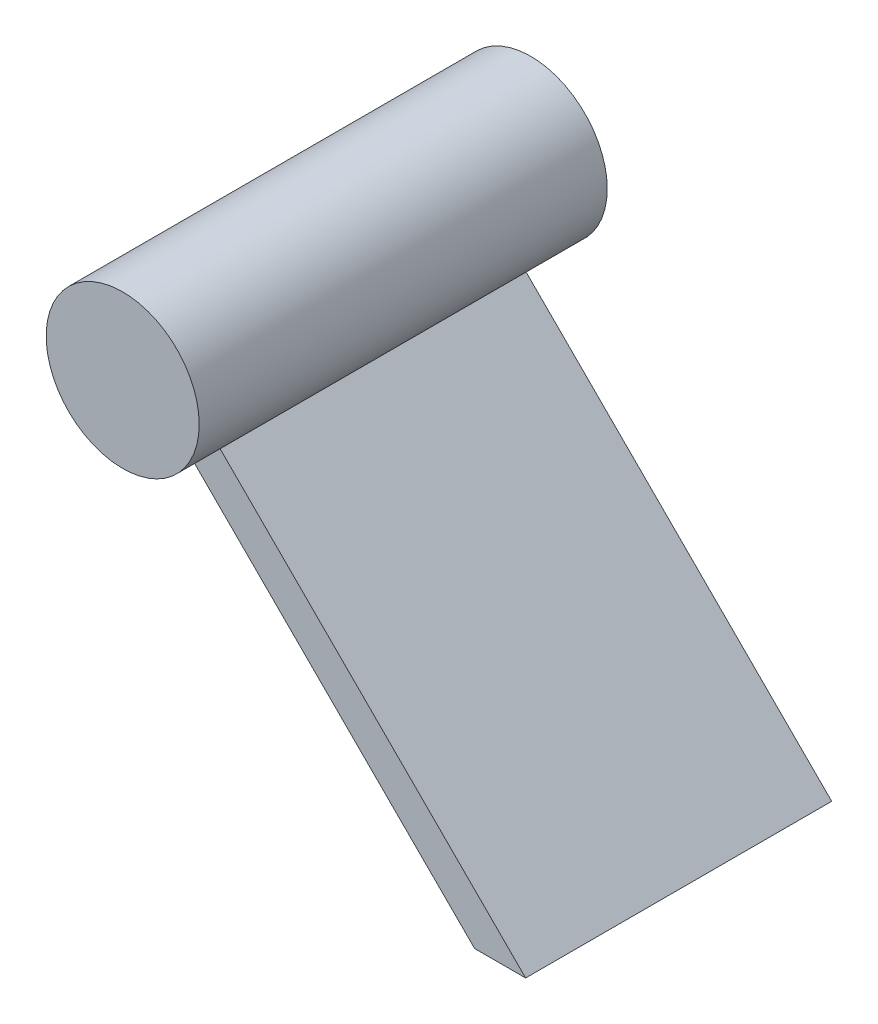
ISO-10303-21;
HEADER;
FILE_DESCRIPTION(('STEP AP214'),'2;1');
FILE_NAME('part.step','',(''),(''),'','','');
FILE_SCHEMA(('AUTOMOTIVE_DESIGN { 1 0 10303 214 1 1 1 1 }'));
ENDSEC;
DATA;
#1=APPLICATION_CONTEXT('core data for automotive mechanical design processes');
#2=APPLICATION_PROTOCOL_DEFINITION('international standard','automotive_design',2000,#1);
#3=PRODUCT_CONTEXT('',#1,'mechanical');
#4=PRODUCT('Part','Part','',(#3));
#5=PRODUCT_RELATED_PRODUCT_CATEGORY('part','',(#4));
#6=PRODUCT_DEFINITION_FORMATION('','',#4);
#7=PRODUCT_DEFINITION_CONTEXT('part definition',#1,'design');
#8=PRODUCT_DEFINITION('design','',#6,#7);
#9=PRODUCT_DEFINITION_SHAPE('','',#8);
#10=(LENGTH_UNIT() NAMED_UNIT(*) SI_UNIT(.MILLI.,.METRE.));
#11=(NAMED_UNIT(*) PLANE_ANGLE_UNIT() SI_UNIT($,.RADIAN.));
#12=(NAMED_UNIT(*) SI_UNIT($,.STERADIAN.) SOLID_ANGLE_UNIT());
#13=UNCERTAINTY_MEASURE_WITH_UNIT(LENGTH_MEASURE(1.E-05),#10,'distance_accuracy_value','');
#14=(GEOMETRIC_REPRESENTATION_CONTEXT(3) GLOBAL_UNCERTAINTY_ASSIGNED_CONTEXT((#13)) GLOBAL_UNIT_ASSIGNED_CONTEXT((#10,
#11,#12)) REPRESENTATION_CONTEXT('',''));
#15=CARTESIAN_POINT('',(0.,0.,0.));
#16=DIRECTION('',(0.,0.,1.));
#17=DIRECTION('',(1.,0.,0.));
#18=AXIS2_PLACEMENT_3D('',#15,#16,#17);
#19=CARTESIAN_POINT('',(0.,0.,15.));
#20=DIRECTION('',(0.707106781186549,0.707106781186546,0.));
#21=DIRECTION('',(-0.707106781186546,0.707106781186549,0.));
#22=AXIS2_PLACEMENT_3D('',#19,#20,#21);
#23=PLANE('',#22);
#24=DIRECTION('',(0.,0.,-1.));
#25=VECTOR('',#24,1.);
#26=CARTESIAN_POINT('',(1.44076365356005,-1.44076365356005,20.));
#27=LINE('',#26,#25);
#28=CARTESIAN_POINT('',(1.44076365356005,-1.44076365356005,-15.));
#29=VERTEX_POINT('',#28);
#30=CARTESIAN_POINT('',(1.44076365356005,-1.44076365356005,15.));
#31=VERTEX_POINT('',#30);
#32=EDGE_CURVE('E160',#29,#31,#27,.F.);
#33=ORIENTED_EDGE('',*,*,#32,.F.);
#34=DIRECTION('',(0.707106781186546,-0.707106781186549,0.));
#35=VECTOR('',#34,1.);
#36=CARTESIAN_POINT('',(0.,0.,-15.));
#37=LINE('',#36,#35);
#38=CARTESIAN_POINT('',(29.9999999999999,-30.,-15.));
#39=VERTEX_POINT('',#38);
#40=EDGE_CURVE('E202',#29,#39,#37,.T.);
#41=ORIENTED_EDGE('',*,*,#40,.T.);
#42=DIRECTION('',(0.,0.,-1.));
#43=VECTOR('',#42,1.);
#44=CARTESIAN_POINT('',(29.9999999999999,-30.,15.));
#45=LINE('',#44,#43);
#46=CARTESIAN_POINT('',(29.9999999999999,-30.,15.));
#47=VERTEX_POINT('',#46);
#48=EDGE_CURVE('E12',#47,#39,#45,.T.);
#49=ORIENTED_EDGE('',*,*,#48,.F.);
#50=DIRECTION('',(0.707106781186546,-0.707106781186549,0.));
#51=VECTOR('',#50,1.);
#52=CARTESIAN_POINT('',(0.,0.,15.));
#53=LINE('',#52,#51);
#54=EDGE_CURVE('E196',#31,#47,#53,.T.);
#55=ORIENTED_EDGE('',*,*,#54,.F.);
#56=EDGE_LOOP('',(#33,#41,#49,#55));
#57=FACE_BOUND('',#56,.T.);
#58=ADVANCED_FACE('F146',(#57),#23,.F.);
#59=CARTESIAN_POINT('',(0.,0.,-15.));
#60=DIRECTION('',(0.,0.,1.));
#61=DIRECTION('',(1.,0.,0.));
#62=AXIS2_PLACEMENT_3D('',#59,#60,#61);
#63=PLANE('',#62);
#64=CARTESIAN_POINT('',(0.5,6.,-15.));
#65=DIRECTION('',(0.,0.,1.));
#66=DIRECTION('',(1.,0.,0.));
#67=AXIS2_PLACEMENT_3D('',#64,#65,#66);
#68=CIRCLE('',#67,7.5);
#69=CARTESIAN_POINT('',(5.,0.,-15.));
#70=VERTEX_POINT('',#69);
#71=EDGE_CURVE('E200',#70,#29,#68,.F.);
#72=ORIENTED_EDGE('',*,*,#71,.F.);
#73=DIRECTION('',(-0.707106781186547,0.707106781186548,0.));
#74=VECTOR('',#73,1.);
#75=CARTESIAN_POINT('',(2.50000000000001,2.5,-15.));
#76=LINE('',#75,#74);
#77=CARTESIAN_POINT('',(34.9999999999999,-30.,-15.));
#78=VERTEX_POINT('',#77);
#79=EDGE_CURVE('E187',#78,#70,#76,.T.);
#80=ORIENTED_EDGE('',*,*,#79,.F.);
#81=DIRECTION('',(1.,0.,0.));
#82=VECTOR('',#81,1.);
#83=CARTESIAN_POINT('',(0.,-30.,-15.));
#84=LINE('',#83,#82);
#85=EDGE_CURVE('E197',#39,#78,#84,.T.);
#86=ORIENTED_EDGE('',*,*,#85,.F.);
#87=ORIENTED_EDGE('',*,*,#40,.F.);
#88=EDGE_LOOP('',(#72,#80,#86,#87));
#89=FACE_BOUND('',#88,.T.);
#90=ADVANCED_FACE('F201',(#89),#63,.F.);
#91=CARTESIAN_POINT('',(0.,-30.,15.));
#92=DIRECTION('',(0.,1.,0.));
#93=DIRECTION('',(-1.,0.,0.));
#94=AXIS2_PLACEMENT_3D('',#91,#92,#93);
#95=PLANE('',#94);
#96=ORIENTED_EDGE('',*,*,#85,.T.);
#97=DIRECTION('',(0.,0.,-1.));
#98=VECTOR('',#97,1.);
#99=CARTESIAN_POINT('',(34.9999999999999,-30.,15.));
#100=LINE('',#99,#98);
#101=CARTESIAN_POINT('',(34.9999999999999,-30.,15.));
#102=VERTEX_POINT('',#101);
#103=EDGE_CURVE('E153',#102,#78,#100,.T.);
#104=ORIENTED_EDGE('',*,*,#103,.F.);
#105=DIRECTION('',(1.,0.,0.));
#106=VECTOR('',#105,1.);
#107=CARTESIAN_POINT('',(0.,-30.,15.));
#108=LINE('',#107,#106);
#109=EDGE_CURVE('E208',#47,#102,#108,.T.);
#110=ORIENTED_EDGE('',*,*,#109,.F.);
#111=ORIENTED_EDGE('',*,*,#48,.T.);
#112=EDGE_LOOP('',(#96,#104,#110,#111));
#113=FACE_BOUND('',#112,.T.);
#114=ADVANCED_FACE('F243',(#113),#95,.F.);
#115=CARTESIAN_POINT('',(2.50000000000001,2.5,15.));
#116=DIRECTION('',(-0.707106781186549,-0.707106781186547,0.));
#117=DIRECTION('',(0.707106781186547,-0.707106781186549,0.));
#118=AXIS2_PLACEMENT_3D('',#115,#116,#117);
#119=PLANE('',#118);
#120=ORIENTED_EDGE('',*,*,#79,.T.);
#121=DIRECTION('',(0.,0.,-1.));
#122=VECTOR('',#121,1.);
#123=CARTESIAN_POINT('',(5.,0.,15.));
#124=LINE('',#123,#122);
#125=CARTESIAN_POINT('',(5.,0.,15.));
#126=VERTEX_POINT('',#125);
#127=EDGE_CURVE('E192',#126,#70,#124,.T.);
#128=ORIENTED_EDGE('',*,*,#127,.F.);
#129=DIRECTION('',(-0.707106781186547,0.707106781186548,0.));
#130=VECTOR('',#129,1.);
#131=CARTESIAN_POINT('',(2.50000000000001,2.5,15.));
#132=LINE('',#131,#130);
#133=EDGE_CURVE('E206',#102,#126,#132,.T.);
#134=ORIENTED_EDGE('',*,*,#133,.F.);
#135=ORIENTED_EDGE('',*,*,#103,.T.);
#136=EDGE_LOOP('',(#120,#128,#134,#135));
#137=FACE_BOUND('',#136,.T.);
#138=ADVANCED_FACE('F189',(#137),#119,.F.);
#139=CARTESIAN_POINT('',(0.,0.,15.));
#140=DIRECTION('',(0.,0.,1.));
#141=DIRECTION('',(1.,0.,0.));
#142=AXIS2_PLACEMENT_3D('',#139,#140,#141);
#143=PLANE('',#142);
#144=ORIENTED_EDGE('',*,*,#133,.T.);
#145=CARTESIAN_POINT('',(0.5,6.,15.));
#146=DIRECTION('',(0.,0.,1.));
#147=DIRECTION('',(1.,0.,0.));
#148=AXIS2_PLACEMENT_3D('',#145,#146,#147);
#149=CIRCLE('',#148,7.5);
#150=EDGE_CURVE('E168',#126,#31,#149,.F.);
#151=ORIENTED_EDGE('',*,*,#150,.T.);
#152=ORIENTED_EDGE('',*,*,#54,.T.);
#153=ORIENTED_EDGE('',*,*,#109,.T.);
#154=EDGE_LOOP('',(#144,#151,#152,#153));
#155=FACE_BOUND('',#154,.T.);
#156=ADVANCED_FACE('F228',(#155),#143,.T.);
#157=CARTESIAN_POINT('',(0.5,6.,20.));
#158=DIRECTION('',(0.,0.,-1.));
#159=DIRECTION('',(-1.,0.,0.));
#160=AXIS2_PLACEMENT_3D('',#157,#158,#159);
#161=CYLINDRICAL_SURFACE('',#160,7.5);
#162=CARTESIAN_POINT('',(0.5,6.,20.));
#163=DIRECTION('',(0.,0.,1.));
#164=DIRECTION('',(1.,0.,0.));
#165=AXIS2_PLACEMENT_3D('',#162,#163,#164);
#166=CIRCLE('',#165,7.5);
#167=CARTESIAN_POINT('',(8.,6.,20.));
#168=VERTEX_POINT('',#167);
#169=EDGE_CURVE('E217',#168,#168,#166,.T.);
#170=ORIENTED_EDGE('',*,*,#169,.F.);
#171=EDGE_LOOP('',(#170));
#172=FACE_BOUND('',#171,.T.);
#173=CARTESIAN_POINT('',(0.5,6.,-20.));
#174=DIRECTION('',(0.,0.,1.));
#175=DIRECTION('',(1.,0.,0.));
#176=AXIS2_PLACEMENT_3D('',#173,#174,#175);
#177=CIRCLE('',#176,7.5);
#178=CARTESIAN_POINT('',(8.,6.,-20.));
#179=VERTEX_POINT('',#178);
#180=EDGE_CURVE('E218',#179,#179,#177,.T.);
#181=ORIENTED_EDGE('',*,*,#180,.T.);
#182=EDGE_LOOP('',(#181));
#183=FACE_BOUND('',#182,.T.);
#184=ORIENTED_EDGE('',*,*,#127,.T.);
#185=ORIENTED_EDGE('',*,*,#71,.T.);
#186=ORIENTED_EDGE('',*,*,#32,.T.);
#187=ORIENTED_EDGE('',*,*,#150,.F.);
#188=EDGE_LOOP('',(#184,#185,#186,#187));
#189=FACE_BOUND('',#188,.T.);
#190=ADVANCED_FACE('F205',(#172,#183,#189),#161,.T.);
#191=CARTESIAN_POINT('',(0.5,6.,20.));
#192=DIRECTION('',(0.,0.,1.));
#193=DIRECTION('',(1.,0.,0.));
#194=AXIS2_PLACEMENT_3D('',#191,#192,#193);
#195=PLANE('',#194);
#196=ORIENTED_EDGE('',*,*,#169,.T.);
#197=EDGE_LOOP('',(#196));
#198=FACE_BOUND('',#197,.T.);
#199=ADVANCED_FACE('F224',(#198),#195,.T.);
#200=CARTESIAN_POINT('',(0.5,6.,-20.));
#201=DIRECTION('',(0.,0.,1.));
#202=DIRECTION('',(1.,0.,0.));
#203=AXIS2_PLACEMENT_3D('',#200,#201,#202);
#204=PLANE('',#203);
#205=ORIENTED_EDGE('',*,*,#180,.F.);
#206=EDGE_LOOP('',(#205));
#207=FACE_BOUND('',#206,.T.);
#208=ADVANCED_FACE('F232',(#207),#204,.F.);
#209=CLOSED_SHELL('',(#58,#90,#114,#138,#156,#190,#199,#208));
#210=MANIFOLD_SOLID_BREP('B2',#209);
#211=ADVANCED_BREP_SHAPE_REPRESENTATION('',(#18,#210),#14);
#212=SHAPE_DEFINITION_REPRESENTATION(#9,#211);
ENDSEC;
END-ISO-10303-21;
